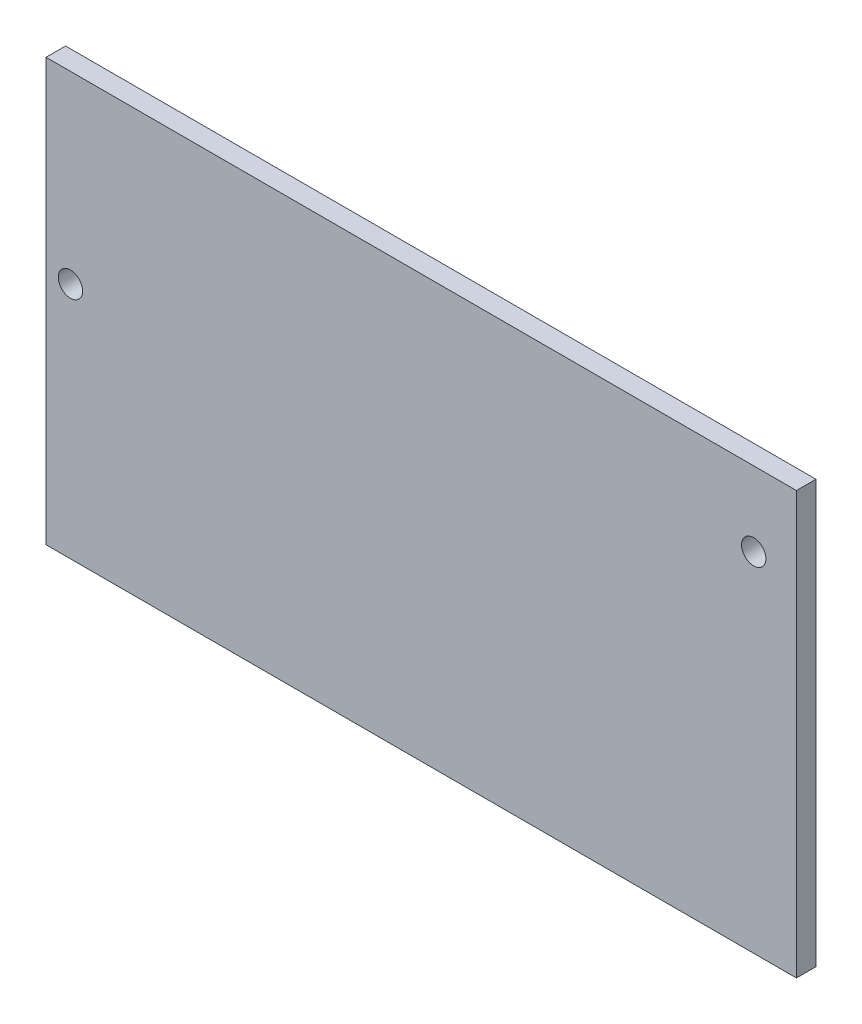
ISO-10303-21;
HEADER;
FILE_DESCRIPTION(('STEP AP214'),'2;1');
FILE_NAME('part.step','',(''),(''),'','','');
FILE_SCHEMA(('AUTOMOTIVE_DESIGN { 1 0 10303 214 1 1 1 1 }'));
ENDSEC;
DATA;
#1=APPLICATION_CONTEXT('core data for automotive mechanical design processes');
#2=APPLICATION_PROTOCOL_DEFINITION('international standard','automotive_design',2000,#1);
#3=PRODUCT_CONTEXT('',#1,'mechanical');
#4=PRODUCT('Part','Part','',(#3));
#5=PRODUCT_RELATED_PRODUCT_CATEGORY('part','',(#4));
#6=PRODUCT_DEFINITION_FORMATION('','',#4);
#7=PRODUCT_DEFINITION_CONTEXT('part definition',#1,'design');
#8=PRODUCT_DEFINITION('design','',#6,#7);
#9=PRODUCT_DEFINITION_SHAPE('','',#8);
#10=(LENGTH_UNIT() NAMED_UNIT(*) SI_UNIT(.MILLI.,.METRE.));
#11=(NAMED_UNIT(*) PLANE_ANGLE_UNIT() SI_UNIT($,.RADIAN.));
#12=(NAMED_UNIT(*) SI_UNIT($,.STERADIAN.) SOLID_ANGLE_UNIT());
#13=UNCERTAINTY_MEASURE_WITH_UNIT(LENGTH_MEASURE(1.E-05),#10,'distance_accuracy_value','');
#14=(GEOMETRIC_REPRESENTATION_CONTEXT(3) GLOBAL_UNCERTAINTY_ASSIGNED_CONTEXT((#13)) GLOBAL_UNIT_ASSIGNED_CONTEXT((#10,
#11,#12)) REPRESENTATION_CONTEXT('',''));
#15=CARTESIAN_POINT('',(0.,0.,0.));
#16=DIRECTION('',(0.,0.,1.));
#17=DIRECTION('',(1.,0.,0.));
#18=AXIS2_PLACEMENT_3D('',#15,#16,#17);
#19=CARTESIAN_POINT('',(0.,0.,1.6));
#20=DIRECTION('',(0.,0.,-1.));
#21=DIRECTION('',(-1.,0.,0.));
#22=AXIS2_PLACEMENT_3D('',#19,#20,#21);
#23=PLANE('',#22);
#24=DIRECTION('',(0.,-1.,0.));
#25=VECTOR('',#24,1.);
#26=CARTESIAN_POINT('',(0.,0.,1.6));
#27=LINE('',#26,#25);
#28=CARTESIAN_POINT('',(0.,34.6,1.6));
#29=VERTEX_POINT('',#28);
#30=CARTESIAN_POINT('',(0.,0.,1.6));
#31=VERTEX_POINT('',#30);
#32=EDGE_CURVE('E84',#29,#31,#27,.T.);
#33=ORIENTED_EDGE('',*,*,#32,.T.);
#34=DIRECTION('',(1.,0.,0.));
#35=VECTOR('',#34,1.);
#36=CARTESIAN_POINT('',(0.,0.,1.6));
#37=LINE('',#36,#35);
#38=CARTESIAN_POINT('',(61.5,0.,1.6));
#39=VERTEX_POINT('',#38);
#40=EDGE_CURVE('E79',#31,#39,#37,.T.);
#41=ORIENTED_EDGE('',*,*,#40,.T.);
#42=DIRECTION('',(0.,1.,0.));
#43=VECTOR('',#42,1.);
#44=CARTESIAN_POINT('',(61.5,0.,1.6));
#45=LINE('',#44,#43);
#46=CARTESIAN_POINT('',(61.5,34.6,1.6));
#47=VERTEX_POINT('',#46);
#48=EDGE_CURVE('E82',#39,#47,#45,.T.);
#49=ORIENTED_EDGE('',*,*,#48,.T.);
#50=DIRECTION('',(-1.,0.,0.));
#51=VECTOR('',#50,1.);
#52=CARTESIAN_POINT('',(0.,34.6,1.6));
#53=LINE('',#52,#51);
#54=EDGE_CURVE('E49',#47,#29,#53,.T.);
#55=ORIENTED_EDGE('',*,*,#54,.T.);
#56=EDGE_LOOP('',(#33,#41,#49,#55));
#57=FACE_BOUND('',#56,.T.);
#58=CARTESIAN_POINT('',(2.,19.5,1.6));
#59=DIRECTION('',(0.,0.,1.));
#60=DIRECTION('',(1.,0.,0.));
#61=AXIS2_PLACEMENT_3D('',#58,#59,#60);
#62=CIRCLE('',#61,1.);
#63=CARTESIAN_POINT('',(3.,19.5,1.6));
#64=VERTEX_POINT('',#63);
#65=EDGE_CURVE('E99',#64,#64,#62,.T.);
#66=ORIENTED_EDGE('',*,*,#65,.F.);
#67=EDGE_LOOP('',(#66));
#68=FACE_BOUND('',#67,.T.);
#69=CARTESIAN_POINT('',(58.,28.5,1.6));
#70=DIRECTION('',(0.,0.,1.));
#71=DIRECTION('',(1.,0.,0.));
#72=AXIS2_PLACEMENT_3D('',#69,#70,#71);
#73=CIRCLE('',#72,0.999999999999998);
#74=CARTESIAN_POINT('',(59.,28.5,1.6));
#75=VERTEX_POINT('',#74);
#76=EDGE_CURVE('E114',#75,#75,#73,.T.);
#77=ORIENTED_EDGE('',*,*,#76,.F.);
#78=EDGE_LOOP('',(#77));
#79=FACE_BOUND('',#78,.T.);
#80=ADVANCED_FACE('F32',(#57,#68,#79),#23,.F.);
#81=CARTESIAN_POINT('',(0.,0.,0.));
#82=DIRECTION('',(0.,0.,-1.));
#83=DIRECTION('',(-1.,0.,0.));
#84=AXIS2_PLACEMENT_3D('',#81,#82,#83);
#85=PLANE('',#84);
#86=CARTESIAN_POINT('',(2.,19.5,0.));
#87=DIRECTION('',(0.,0.,1.));
#88=DIRECTION('',(1.,0.,0.));
#89=AXIS2_PLACEMENT_3D('',#86,#87,#88);
#90=CIRCLE('',#89,1.);
#91=CARTESIAN_POINT('',(3.,19.5,0.));
#92=VERTEX_POINT('',#91);
#93=EDGE_CURVE('E111',#92,#92,#90,.T.);
#94=ORIENTED_EDGE('',*,*,#93,.T.);
#95=EDGE_LOOP('',(#94));
#96=FACE_BOUND('',#95,.T.);
#97=DIRECTION('',(0.,-1.,0.));
#98=VECTOR('',#97,1.);
#99=CARTESIAN_POINT('',(0.,0.,0.));
#100=LINE('',#99,#98);
#101=CARTESIAN_POINT('',(0.,34.6,0.));
#102=VERTEX_POINT('',#101);
#103=CARTESIAN_POINT('',(0.,0.,0.));
#104=VERTEX_POINT('',#103);
#105=EDGE_CURVE('E96',#102,#104,#100,.T.);
#106=ORIENTED_EDGE('',*,*,#105,.F.);
#107=DIRECTION('',(-1.,0.,0.));
#108=VECTOR('',#107,1.);
#109=CARTESIAN_POINT('',(0.,34.6,0.));
#110=LINE('',#109,#108);
#111=CARTESIAN_POINT('',(61.5,34.6,0.));
#112=VERTEX_POINT('',#111);
#113=EDGE_CURVE('E72',#112,#102,#110,.T.);
#114=ORIENTED_EDGE('',*,*,#113,.F.);
#115=DIRECTION('',(0.,1.,0.));
#116=VECTOR('',#115,1.);
#117=CARTESIAN_POINT('',(61.5,0.,0.));
#118=LINE('',#117,#116);
#119=CARTESIAN_POINT('',(61.5,0.,0.));
#120=VERTEX_POINT('',#119);
#121=EDGE_CURVE('E66',#120,#112,#118,.T.);
#122=ORIENTED_EDGE('',*,*,#121,.F.);
#123=DIRECTION('',(1.,0.,0.));
#124=VECTOR('',#123,1.);
#125=CARTESIAN_POINT('',(0.,0.,0.));
#126=LINE('',#125,#124);
#127=EDGE_CURVE('E88',#104,#120,#126,.T.);
#128=ORIENTED_EDGE('',*,*,#127,.F.);
#129=EDGE_LOOP('',(#106,#114,#122,#128));
#130=FACE_BOUND('',#129,.T.);
#131=CARTESIAN_POINT('',(58.,28.5,0.));
#132=DIRECTION('',(0.,0.,1.));
#133=DIRECTION('',(1.,0.,0.));
#134=AXIS2_PLACEMENT_3D('',#131,#132,#133);
#135=CIRCLE('',#134,0.999999999999998);
#136=CARTESIAN_POINT('',(59.,28.5,0.));
#137=VERTEX_POINT('',#136);
#138=EDGE_CURVE('E117',#137,#137,#135,.T.);
#139=ORIENTED_EDGE('',*,*,#138,.T.);
#140=EDGE_LOOP('',(#139));
#141=FACE_BOUND('',#140,.T.);
#142=ADVANCED_FACE('F107',(#96,#130,#141),#85,.T.);
#143=CARTESIAN_POINT('',(0.,0.,1.6));
#144=DIRECTION('',(1.,0.,0.));
#145=DIRECTION('',(0.,0.,-1.));
#146=AXIS2_PLACEMENT_3D('',#143,#144,#145);
#147=PLANE('',#146);
#148=ORIENTED_EDGE('',*,*,#105,.T.);
#149=DIRECTION('',(0.,0.,-1.));
#150=VECTOR('',#149,1.);
#151=CARTESIAN_POINT('',(0.,0.,1.6));
#152=LINE('',#151,#150);
#153=EDGE_CURVE('E11',#31,#104,#152,.T.);
#154=ORIENTED_EDGE('',*,*,#153,.F.);
#155=ORIENTED_EDGE('',*,*,#32,.F.);
#156=DIRECTION('',(0.,0.,-1.));
#157=VECTOR('',#156,1.);
#158=CARTESIAN_POINT('',(0.,34.6,1.6));
#159=LINE('',#158,#157);
#160=EDGE_CURVE('E92',#29,#102,#159,.T.);
#161=ORIENTED_EDGE('',*,*,#160,.T.);
#162=EDGE_LOOP('',(#148,#154,#155,#161));
#163=FACE_BOUND('',#162,.T.);
#164=ADVANCED_FACE('F34',(#163),#147,.F.);
#165=CARTESIAN_POINT('',(0.,0.,1.6));
#166=DIRECTION('',(0.,1.,0.));
#167=DIRECTION('',(0.,0.,1.));
#168=AXIS2_PLACEMENT_3D('',#165,#166,#167);
#169=PLANE('',#168);
#170=ORIENTED_EDGE('',*,*,#127,.T.);
#171=DIRECTION('',(0.,0.,-1.));
#172=VECTOR('',#171,1.);
#173=CARTESIAN_POINT('',(61.5,0.,1.6));
#174=LINE('',#173,#172);
#175=EDGE_CURVE('E41',#39,#120,#174,.T.);
#176=ORIENTED_EDGE('',*,*,#175,.F.);
#177=ORIENTED_EDGE('',*,*,#40,.F.);
#178=ORIENTED_EDGE('',*,*,#153,.T.);
#179=EDGE_LOOP('',(#170,#176,#177,#178));
#180=FACE_BOUND('',#179,.T.);
#181=ADVANCED_FACE('F87',(#180),#169,.F.);
#182=CARTESIAN_POINT('',(61.5,0.,1.6));
#183=DIRECTION('',(-1.,0.,0.));
#184=DIRECTION('',(0.,0.,1.));
#185=AXIS2_PLACEMENT_3D('',#182,#183,#184);
#186=PLANE('',#185);
#187=ORIENTED_EDGE('',*,*,#121,.T.);
#188=DIRECTION('',(0.,0.,-1.));
#189=VECTOR('',#188,1.);
#190=CARTESIAN_POINT('',(61.5,34.6,1.6));
#191=LINE('',#190,#189);
#192=EDGE_CURVE('E89',#47,#112,#191,.T.);
#193=ORIENTED_EDGE('',*,*,#192,.F.);
#194=ORIENTED_EDGE('',*,*,#48,.F.);
#195=ORIENTED_EDGE('',*,*,#175,.T.);
#196=EDGE_LOOP('',(#187,#193,#194,#195));
#197=FACE_BOUND('',#196,.T.);
#198=ADVANCED_FACE('F90',(#197),#186,.F.);
#199=CARTESIAN_POINT('',(0.,34.6,1.6));
#200=DIRECTION('',(0.,-1.,0.));
#201=DIRECTION('',(0.,0.,-1.));
#202=AXIS2_PLACEMENT_3D('',#199,#200,#201);
#203=PLANE('',#202);
#204=ORIENTED_EDGE('',*,*,#113,.T.);
#205=ORIENTED_EDGE('',*,*,#160,.F.);
#206=ORIENTED_EDGE('',*,*,#54,.F.);
#207=ORIENTED_EDGE('',*,*,#192,.T.);
#208=EDGE_LOOP('',(#204,#205,#206,#207));
#209=FACE_BOUND('',#208,.T.);
#210=ADVANCED_FACE('F104',(#209),#203,.F.);
#211=CARTESIAN_POINT('',(2.,19.5,1.6));
#212=DIRECTION('',(0.,0.,-1.));
#213=DIRECTION('',(-1.,0.,0.));
#214=AXIS2_PLACEMENT_3D('',#211,#212,#213);
#215=CYLINDRICAL_SURFACE('',#214,1.);
#216=ORIENTED_EDGE('',*,*,#65,.T.);
#217=EDGE_LOOP('',(#216));
#218=FACE_BOUND('',#217,.T.);
#219=ORIENTED_EDGE('',*,*,#93,.F.);
#220=EDGE_LOOP('',(#219));
#221=FACE_BOUND('',#220,.T.);
#222=ADVANCED_FACE('F134',(#218,#221),#215,.F.);
#223=CARTESIAN_POINT('',(58.,28.5,1.6));
#224=DIRECTION('',(0.,0.,-1.));
#225=DIRECTION('',(-1.,0.,0.));
#226=AXIS2_PLACEMENT_3D('',#223,#224,#225);
#227=CYLINDRICAL_SURFACE('',#226,0.999999999999998);
#228=ORIENTED_EDGE('',*,*,#76,.T.);
#229=EDGE_LOOP('',(#228));
#230=FACE_BOUND('',#229,.T.);
#231=ORIENTED_EDGE('',*,*,#138,.F.);
#232=EDGE_LOOP('',(#231));
#233=FACE_BOUND('',#232,.T.);
#234=ADVANCED_FACE('F123',(#230,#233),#227,.F.);
#235=CLOSED_SHELL('',(#80,#142,#164,#181,#198,#210,#222,#234));
#236=MANIFOLD_SOLID_BREP('B2',#235);
#237=ADVANCED_BREP_SHAPE_REPRESENTATION('',(#18,#236),#14);
#238=SHAPE_DEFINITION_REPRESENTATION(#9,#237);
ENDSEC;
END-ISO-10303-21;
